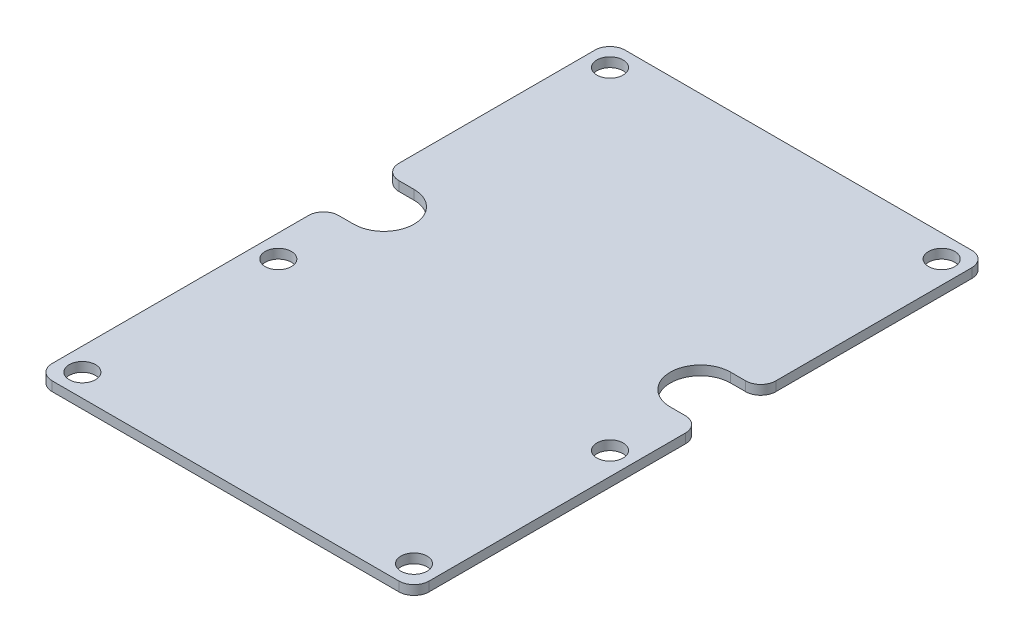
ISO-10303-21;
HEADER;
FILE_DESCRIPTION(('STEP AP214'),'2;1');
FILE_NAME('part.step','',(''),(''),'','','');
FILE_SCHEMA(('AUTOMOTIVE_DESIGN { 1 0 10303 214 1 1 1 1 }'));
ENDSEC;
DATA;
#1=APPLICATION_CONTEXT('core data for automotive mechanical design processes');
#2=APPLICATION_PROTOCOL_DEFINITION('international standard','automotive_design',2000,#1);
#3=PRODUCT_CONTEXT('',#1,'mechanical');
#4=PRODUCT('Part','Part','',(#3));
#5=PRODUCT_RELATED_PRODUCT_CATEGORY('part','',(#4));
#6=PRODUCT_DEFINITION_FORMATION('','',#4);
#7=PRODUCT_DEFINITION_CONTEXT('part definition',#1,'design');
#8=PRODUCT_DEFINITION('design','',#6,#7);
#9=PRODUCT_DEFINITION_SHAPE('','',#8);
#10=(LENGTH_UNIT() NAMED_UNIT(*) SI_UNIT(.MILLI.,.METRE.));
#11=(NAMED_UNIT(*) PLANE_ANGLE_UNIT() SI_UNIT($,.RADIAN.));
#12=(NAMED_UNIT(*) SI_UNIT($,.STERADIAN.) SOLID_ANGLE_UNIT());
#13=UNCERTAINTY_MEASURE_WITH_UNIT(LENGTH_MEASURE(1.E-05),#10,'distance_accuracy_value','');
#14=(GEOMETRIC_REPRESENTATION_CONTEXT(3) GLOBAL_UNCERTAINTY_ASSIGNED_CONTEXT((#13)) GLOBAL_UNIT_ASSIGNED_CONTEXT((#10,
#11,#12)) REPRESENTATION_CONTEXT('',''));
#15=CARTESIAN_POINT('',(0.,0.,0.));
#16=DIRECTION('',(0.,0.,1.));
#17=DIRECTION('',(1.,0.,0.));
#18=AXIS2_PLACEMENT_3D('',#15,#16,#17);
#19=CARTESIAN_POINT('',(-29.21,-1.5875,17.78));
#20=DIRECTION('',(0.,1.,0.));
#21=DIRECTION('',(0.,0.,1.));
#22=AXIS2_PLACEMENT_3D('',#19,#20,#21);
#23=CYLINDRICAL_SURFACE('',#22,2.54);
#24=CARTESIAN_POINT('',(-29.21,0.,17.78));
#25=DIRECTION('',(0.,1.,0.));
#26=DIRECTION('',(0.,0.,1.));
#27=AXIS2_PLACEMENT_3D('',#24,#25,#26);
#28=CIRCLE('',#27,2.54);
#29=CARTESIAN_POINT('',(-31.75,0.,17.78));
#30=VERTEX_POINT('',#29);
#31=CARTESIAN_POINT('',(-29.21,0.,20.32));
#32=VERTEX_POINT('',#31);
#33=EDGE_CURVE('E213',#30,#32,#28,.T.);
#34=ORIENTED_EDGE('',*,*,#33,.F.);
#35=DIRECTION('',(0.,1.,0.));
#36=VECTOR('',#35,1.);
#37=CARTESIAN_POINT('',(-31.75,-1.5875,17.78));
#38=LINE('',#37,#36);
#39=CARTESIAN_POINT('',(-31.75,-1.5875,17.78));
#40=VERTEX_POINT('',#39);
#41=EDGE_CURVE('E11',#40,#30,#38,.T.);
#42=ORIENTED_EDGE('',*,*,#41,.F.);
#43=CARTESIAN_POINT('',(-29.21,-1.5875,17.78));
#44=DIRECTION('',(0.,1.,0.));
#45=DIRECTION('',(0.,0.,1.));
#46=AXIS2_PLACEMENT_3D('',#43,#44,#45);
#47=CIRCLE('',#46,2.54);
#48=CARTESIAN_POINT('',(-29.21,-1.5875,20.32));
#49=VERTEX_POINT('',#48);
#50=EDGE_CURVE('E290',#40,#49,#47,.T.);
#51=ORIENTED_EDGE('',*,*,#50,.T.);
#52=DIRECTION('',(0.,1.,0.));
#53=VECTOR('',#52,1.);
#54=CARTESIAN_POINT('',(-29.21,-1.5875,20.32));
#55=LINE('',#54,#53);
#56=EDGE_CURVE('E41',#49,#32,#55,.T.);
#57=ORIENTED_EDGE('',*,*,#56,.T.);
#58=EDGE_LOOP('',(#34,#42,#51,#57));
#59=FACE_BOUND('',#58,.T.);
#60=ADVANCED_FACE('F38',(#59),#23,.T.);
#61=CARTESIAN_POINT('',(-31.75,-1.5875,-25.4));
#62=DIRECTION('',(-1.,0.,0.));
#63=DIRECTION('',(0.,0.,1.));
#64=AXIS2_PLACEMENT_3D('',#61,#62,#63);
#65=PLANE('',#64);
#66=DIRECTION('',(0.,0.,1.));
#67=VECTOR('',#66,1.);
#68=CARTESIAN_POINT('',(-31.75,0.,-25.4));
#69=LINE('',#68,#67);
#70=CARTESIAN_POINT('',(-31.75,0.,-25.4));
#71=VERTEX_POINT('',#70);
#72=EDGE_CURVE('E287',#71,#30,#69,.T.);
#73=ORIENTED_EDGE('',*,*,#72,.F.);
#74=DIRECTION('',(0.,1.,0.));
#75=VECTOR('',#74,1.);
#76=CARTESIAN_POINT('',(-31.75,-1.5875,-25.4));
#77=LINE('',#76,#75);
#78=CARTESIAN_POINT('',(-31.75,-1.5875,-25.4));
#79=VERTEX_POINT('',#78);
#80=EDGE_CURVE('E48',#79,#71,#77,.T.);
#81=ORIENTED_EDGE('',*,*,#80,.F.);
#82=DIRECTION('',(0.,0.,1.));
#83=VECTOR('',#82,1.);
#84=CARTESIAN_POINT('',(-31.75,-1.5875,-25.4));
#85=LINE('',#84,#83);
#86=EDGE_CURVE('E199',#79,#40,#85,.T.);
#87=ORIENTED_EDGE('',*,*,#86,.T.);
#88=ORIENTED_EDGE('',*,*,#41,.T.);
#89=EDGE_LOOP('',(#73,#81,#87,#88));
#90=FACE_BOUND('',#89,.T.);
#91=ADVANCED_FACE('F344',(#90),#65,.T.);
#92=CARTESIAN_POINT('',(-29.21,-1.5875,-25.4));
#93=DIRECTION('',(0.,1.,0.));
#94=DIRECTION('',(0.,0.,1.));
#95=AXIS2_PLACEMENT_3D('',#92,#93,#94);
#96=CYLINDRICAL_SURFACE('',#95,2.54);
#97=CARTESIAN_POINT('',(-29.21,0.,-25.4));
#98=DIRECTION('',(0.,1.,0.));
#99=DIRECTION('',(0.,0.,-1.));
#100=AXIS2_PLACEMENT_3D('',#97,#98,#99);
#101=CIRCLE('',#100,2.54);
#102=CARTESIAN_POINT('',(-29.21,0.,-27.94));
#103=VERTEX_POINT('',#102);
#104=EDGE_CURVE('E185',#103,#71,#101,.T.);
#105=ORIENTED_EDGE('',*,*,#104,.F.);
#106=DIRECTION('',(0.,1.,0.));
#107=VECTOR('',#106,1.);
#108=CARTESIAN_POINT('',(-29.21,-1.5875,-27.94));
#109=LINE('',#108,#107);
#110=CARTESIAN_POINT('',(-29.21,-1.5875,-27.94));
#111=VERTEX_POINT('',#110);
#112=EDGE_CURVE('E180',#111,#103,#109,.T.);
#113=ORIENTED_EDGE('',*,*,#112,.F.);
#114=CARTESIAN_POINT('',(-29.21,-1.5875,-25.4));
#115=DIRECTION('',(0.,1.,0.));
#116=DIRECTION('',(0.,0.,-1.));
#117=AXIS2_PLACEMENT_3D('',#114,#115,#116);
#118=CIRCLE('',#117,2.54);
#119=EDGE_CURVE('E183',#111,#79,#118,.T.);
#120=ORIENTED_EDGE('',*,*,#119,.T.);
#121=ORIENTED_EDGE('',*,*,#80,.T.);
#122=EDGE_LOOP('',(#105,#113,#120,#121));
#123=FACE_BOUND('',#122,.T.);
#124=ADVANCED_FACE('F182',(#123),#96,.T.);
#125=CARTESIAN_POINT('',(-26.67,-1.5875,-27.94));
#126=DIRECTION('',(0.,0.,-1.));
#127=DIRECTION('',(-1.,0.,0.));
#128=AXIS2_PLACEMENT_3D('',#125,#126,#127);
#129=PLANE('',#128);
#130=DIRECTION('',(-1.,0.,0.));
#131=VECTOR('',#130,1.);
#132=CARTESIAN_POINT('',(-26.67,0.,-27.94));
#133=LINE('',#132,#131);
#134=CARTESIAN_POINT('',(-26.67,0.,-27.94));
#135=VERTEX_POINT('',#134);
#136=EDGE_CURVE('E282',#135,#103,#133,.T.);
#137=ORIENTED_EDGE('',*,*,#136,.F.);
#138=DIRECTION('',(0.,1.,0.));
#139=VECTOR('',#138,1.);
#140=CARTESIAN_POINT('',(-26.67,-1.5875,-27.94));
#141=LINE('',#140,#139);
#142=CARTESIAN_POINT('',(-26.67,-1.5875,-27.94));
#143=VERTEX_POINT('',#142);
#144=EDGE_CURVE('E191',#143,#135,#141,.T.);
#145=ORIENTED_EDGE('',*,*,#144,.F.);
#146=DIRECTION('',(-1.,0.,0.));
#147=VECTOR('',#146,1.);
#148=CARTESIAN_POINT('',(-26.67,-1.5875,-27.94));
#149=LINE('',#148,#147);
#150=EDGE_CURVE('E197',#143,#111,#149,.T.);
#151=ORIENTED_EDGE('',*,*,#150,.T.);
#152=ORIENTED_EDGE('',*,*,#112,.T.);
#153=EDGE_LOOP('',(#137,#145,#151,#152));
#154=FACE_BOUND('',#153,.T.);
#155=ADVANCED_FACE('F202',(#154),#129,.T.);
#156=CARTESIAN_POINT('',(-26.67,-1.5875,-33.02));
#157=DIRECTION('',(0.,1.,0.));
#158=DIRECTION('',(0.,0.,1.));
#159=AXIS2_PLACEMENT_3D('',#156,#157,#158);
#160=CYLINDRICAL_SURFACE('',#159,5.08);
#161=CARTESIAN_POINT('',(-26.67,0.,-33.02));
#162=DIRECTION('',(0.,-1.,0.));
#163=DIRECTION('',(0.,0.,-1.));
#164=AXIS2_PLACEMENT_3D('',#161,#162,#163);
#165=CIRCLE('',#164,5.08);
#166=CARTESIAN_POINT('',(-26.67,0.,-38.1));
#167=VERTEX_POINT('',#166);
#168=EDGE_CURVE('E278',#167,#135,#165,.T.);
#169=ORIENTED_EDGE('',*,*,#168,.F.);
#170=DIRECTION('',(0.,1.,0.));
#171=VECTOR('',#170,1.);
#172=CARTESIAN_POINT('',(-26.67,-1.5875,-38.1));
#173=LINE('',#172,#171);
#174=CARTESIAN_POINT('',(-26.67,-1.5875,-38.1));
#175=VERTEX_POINT('',#174);
#176=EDGE_CURVE('E296',#175,#167,#173,.T.);
#177=ORIENTED_EDGE('',*,*,#176,.F.);
#178=CARTESIAN_POINT('',(-26.67,-1.5875,-33.02));
#179=DIRECTION('',(0.,-1.,0.));
#180=DIRECTION('',(0.,0.,-1.));
#181=AXIS2_PLACEMENT_3D('',#178,#179,#180);
#182=CIRCLE('',#181,5.08);
#183=EDGE_CURVE('E204',#175,#143,#182,.T.);
#184=ORIENTED_EDGE('',*,*,#183,.T.);
#185=ORIENTED_EDGE('',*,*,#144,.T.);
#186=EDGE_LOOP('',(#169,#177,#184,#185));
#187=FACE_BOUND('',#186,.T.);
#188=ADVANCED_FACE('F357',(#187),#160,.F.);
#189=CARTESIAN_POINT('',(-29.21,-1.5875,-38.1));
#190=DIRECTION('',(0.,0.,1.));
#191=DIRECTION('',(1.,0.,0.));
#192=AXIS2_PLACEMENT_3D('',#189,#190,#191);
#193=PLANE('',#192);
#194=DIRECTION('',(1.,0.,0.));
#195=VECTOR('',#194,1.);
#196=CARTESIAN_POINT('',(-29.21,0.,-38.1));
#197=LINE('',#196,#195);
#198=CARTESIAN_POINT('',(-29.21,0.,-38.1));
#199=VERTEX_POINT('',#198);
#200=EDGE_CURVE('E274',#199,#167,#197,.T.);
#201=ORIENTED_EDGE('',*,*,#200,.F.);
#202=DIRECTION('',(0.,1.,0.));
#203=VECTOR('',#202,1.);
#204=CARTESIAN_POINT('',(-29.21,-1.5875,-38.1));
#205=LINE('',#204,#203);
#206=CARTESIAN_POINT('',(-29.21,-1.5875,-38.1));
#207=VERTEX_POINT('',#206);
#208=EDGE_CURVE('E299',#207,#199,#205,.T.);
#209=ORIENTED_EDGE('',*,*,#208,.F.);
#210=DIRECTION('',(1.,0.,0.));
#211=VECTOR('',#210,1.);
#212=CARTESIAN_POINT('',(-29.21,-1.5875,-38.1));
#213=LINE('',#212,#211);
#214=EDGE_CURVE('E207',#207,#175,#213,.T.);
#215=ORIENTED_EDGE('',*,*,#214,.T.);
#216=ORIENTED_EDGE('',*,*,#176,.T.);
#217=EDGE_LOOP('',(#201,#209,#215,#216));
#218=FACE_BOUND('',#217,.T.);
#219=ADVANCED_FACE('F360',(#218),#193,.T.);
#220=CARTESIAN_POINT('',(-29.21,-1.5875,-40.64));
#221=DIRECTION('',(0.,1.,0.));
#222=DIRECTION('',(0.,0.,1.));
#223=AXIS2_PLACEMENT_3D('',#220,#221,#222);
#224=CYLINDRICAL_SURFACE('',#223,2.54);
#225=CARTESIAN_POINT('',(-29.21,0.,-40.64));
#226=DIRECTION('',(0.,1.,0.));
#227=DIRECTION('',(0.,0.,-1.));
#228=AXIS2_PLACEMENT_3D('',#225,#226,#227);
#229=CIRCLE('',#228,2.54);
#230=CARTESIAN_POINT('',(-31.75,0.,-40.64));
#231=VERTEX_POINT('',#230);
#232=EDGE_CURVE('E270',#231,#199,#229,.T.);
#233=ORIENTED_EDGE('',*,*,#232,.F.);
#234=DIRECTION('',(0.,1.,0.));
#235=VECTOR('',#234,1.);
#236=CARTESIAN_POINT('',(-31.75,-1.5875,-40.64));
#237=LINE('',#236,#235);
#238=CARTESIAN_POINT('',(-31.75,-1.5875,-40.64));
#239=VERTEX_POINT('',#238);
#240=EDGE_CURVE('E302',#239,#231,#237,.T.);
#241=ORIENTED_EDGE('',*,*,#240,.F.);
#242=CARTESIAN_POINT('',(-29.21,-1.5875,-40.64));
#243=DIRECTION('',(0.,1.,0.));
#244=DIRECTION('',(0.,0.,-1.));
#245=AXIS2_PLACEMENT_3D('',#242,#243,#244);
#246=CIRCLE('',#245,2.54);
#247=EDGE_CURVE('E557',#239,#207,#246,.T.);
#248=ORIENTED_EDGE('',*,*,#247,.T.);
#249=ORIENTED_EDGE('',*,*,#208,.T.);
#250=EDGE_LOOP('',(#233,#241,#248,#249));
#251=FACE_BOUND('',#250,.T.);
#252=ADVANCED_FACE('F364',(#251),#224,.T.);
#253=CARTESIAN_POINT('',(-31.75,-1.5875,-73.66));
#254=DIRECTION('',(-1.,0.,0.));
#255=DIRECTION('',(0.,0.,1.));
#256=AXIS2_PLACEMENT_3D('',#253,#254,#255);
#257=PLANE('',#256);
#258=DIRECTION('',(0.,0.,1.));
#259=VECTOR('',#258,1.);
#260=CARTESIAN_POINT('',(-31.75,0.,-73.66));
#261=LINE('',#260,#259);
#262=CARTESIAN_POINT('',(-31.75,0.,-73.66));
#263=VERTEX_POINT('',#262);
#264=EDGE_CURVE('E266',#263,#231,#261,.T.);
#265=ORIENTED_EDGE('',*,*,#264,.F.);
#266=DIRECTION('',(0.,1.,0.));
#267=VECTOR('',#266,1.);
#268=CARTESIAN_POINT('',(-31.75,-1.5875,-73.66));
#269=LINE('',#268,#267);
#270=CARTESIAN_POINT('',(-31.75,-1.5875,-73.66));
#271=VERTEX_POINT('',#270);
#272=EDGE_CURVE('E305',#271,#263,#269,.T.);
#273=ORIENTED_EDGE('',*,*,#272,.F.);
#274=DIRECTION('',(0.,0.,1.));
#275=VECTOR('',#274,1.);
#276=CARTESIAN_POINT('',(-31.75,-1.5875,-73.66));
#277=LINE('',#276,#275);
#278=EDGE_CURVE('E553',#271,#239,#277,.T.);
#279=ORIENTED_EDGE('',*,*,#278,.T.);
#280=ORIENTED_EDGE('',*,*,#240,.T.);
#281=EDGE_LOOP('',(#265,#273,#279,#280));
#282=FACE_BOUND('',#281,.T.);
#283=ADVANCED_FACE('F368',(#282),#257,.T.);
#284=CARTESIAN_POINT('',(-29.21,-1.5875,-73.66));
#285=DIRECTION('',(0.,1.,0.));
#286=DIRECTION('',(0.,0.,1.));
#287=AXIS2_PLACEMENT_3D('',#284,#285,#286);
#288=CYLINDRICAL_SURFACE('',#287,2.54);
#289=CARTESIAN_POINT('',(-29.21,0.,-73.66));
#290=DIRECTION('',(0.,1.,0.));
#291=DIRECTION('',(0.,0.,1.));
#292=AXIS2_PLACEMENT_3D('',#289,#290,#291);
#293=CIRCLE('',#292,2.54);
#294=CARTESIAN_POINT('',(-29.21,0.,-76.2));
#295=VERTEX_POINT('',#294);
#296=EDGE_CURVE('E262',#295,#263,#293,.T.);
#297=ORIENTED_EDGE('',*,*,#296,.F.);
#298=DIRECTION('',(0.,1.,0.));
#299=VECTOR('',#298,1.);
#300=CARTESIAN_POINT('',(-29.21,-1.5875,-76.2));
#301=LINE('',#300,#299);
#302=CARTESIAN_POINT('',(-29.21,-1.5875,-76.2));
#303=VERTEX_POINT('',#302);
#304=EDGE_CURVE('E308',#303,#295,#301,.T.);
#305=ORIENTED_EDGE('',*,*,#304,.F.);
#306=CARTESIAN_POINT('',(-29.21,-1.5875,-73.66));
#307=DIRECTION('',(0.,1.,0.));
#308=DIRECTION('',(0.,0.,1.));
#309=AXIS2_PLACEMENT_3D('',#306,#307,#308);
#310=CIRCLE('',#309,2.54);
#311=EDGE_CURVE('E549',#303,#271,#310,.T.);
#312=ORIENTED_EDGE('',*,*,#311,.T.);
#313=ORIENTED_EDGE('',*,*,#272,.T.);
#314=EDGE_LOOP('',(#297,#305,#312,#313));
#315=FACE_BOUND('',#314,.T.);
#316=ADVANCED_FACE('F372',(#315),#288,.T.);
#317=CARTESIAN_POINT('',(-29.21,-1.5875,-76.2));
#318=DIRECTION('',(0.,0.,-1.));
#319=DIRECTION('',(-1.,0.,0.));
#320=AXIS2_PLACEMENT_3D('',#317,#318,#319);
#321=PLANE('',#320);
#322=DIRECTION('',(-1.,0.,0.));
#323=VECTOR('',#322,1.);
#324=CARTESIAN_POINT('',(-29.21,0.,-76.2));
#325=LINE('',#324,#323);
#326=CARTESIAN_POINT('',(29.21,0.,-76.2));
#327=VERTEX_POINT('',#326);
#328=EDGE_CURVE('E258',#327,#295,#325,.T.);
#329=ORIENTED_EDGE('',*,*,#328,.F.);
#330=DIRECTION('',(0.,1.,0.));
#331=VECTOR('',#330,1.);
#332=CARTESIAN_POINT('',(29.21,-1.5875,-76.2));
#333=LINE('',#332,#331);
#334=CARTESIAN_POINT('',(29.21,-1.5875,-76.2));
#335=VERTEX_POINT('',#334);
#336=EDGE_CURVE('E311',#335,#327,#333,.T.);
#337=ORIENTED_EDGE('',*,*,#336,.F.);
#338=DIRECTION('',(-1.,0.,0.));
#339=VECTOR('',#338,1.);
#340=CARTESIAN_POINT('',(-29.21,-1.5875,-76.2));
#341=LINE('',#340,#339);
#342=EDGE_CURVE('E545',#335,#303,#341,.T.);
#343=ORIENTED_EDGE('',*,*,#342,.T.);
#344=ORIENTED_EDGE('',*,*,#304,.T.);
#345=EDGE_LOOP('',(#329,#337,#343,#344));
#346=FACE_BOUND('',#345,.T.);
#347=ADVANCED_FACE('F376',(#346),#321,.T.);
#348=CARTESIAN_POINT('',(29.21,-1.5875,-73.66));
#349=DIRECTION('',(0.,1.,0.));
#350=DIRECTION('',(0.,0.,1.));
#351=AXIS2_PLACEMENT_3D('',#348,#349,#350);
#352=CYLINDRICAL_SURFACE('',#351,2.54);
#353=CARTESIAN_POINT('',(29.21,0.,-73.66));
#354=DIRECTION('',(0.,1.,0.));
#355=DIRECTION('',(0.,0.,-1.));
#356=AXIS2_PLACEMENT_3D('',#353,#354,#355);
#357=CIRCLE('',#356,2.54);
#358=CARTESIAN_POINT('',(31.75,0.,-73.66));
#359=VERTEX_POINT('',#358);
#360=EDGE_CURVE('E254',#359,#327,#357,.T.);
#361=ORIENTED_EDGE('',*,*,#360,.F.);
#362=DIRECTION('',(0.,1.,0.));
#363=VECTOR('',#362,1.);
#364=CARTESIAN_POINT('',(31.75,-1.5875,-73.66));
#365=LINE('',#364,#363);
#366=CARTESIAN_POINT('',(31.75,-1.5875,-73.66));
#367=VERTEX_POINT('',#366);
#368=EDGE_CURVE('E314',#367,#359,#365,.T.);
#369=ORIENTED_EDGE('',*,*,#368,.F.);
#370=CARTESIAN_POINT('',(29.21,-1.5875,-73.66));
#371=DIRECTION('',(0.,1.,0.));
#372=DIRECTION('',(0.,0.,-1.));
#373=AXIS2_PLACEMENT_3D('',#370,#371,#372);
#374=CIRCLE('',#373,2.54);
#375=EDGE_CURVE('E541',#367,#335,#374,.T.);
#376=ORIENTED_EDGE('',*,*,#375,.T.);
#377=ORIENTED_EDGE('',*,*,#336,.T.);
#378=EDGE_LOOP('',(#361,#369,#376,#377));
#379=FACE_BOUND('',#378,.T.);
#380=ADVANCED_FACE('F380',(#379),#352,.T.);
#381=CARTESIAN_POINT('',(31.75,-1.5875,-40.64));
#382=DIRECTION('',(1.,0.,0.));
#383=DIRECTION('',(0.,0.,-1.));
#384=AXIS2_PLACEMENT_3D('',#381,#382,#383);
#385=PLANE('',#384);
#386=DIRECTION('',(0.,0.,-1.));
#387=VECTOR('',#386,1.);
#388=CARTESIAN_POINT('',(31.75,0.,-40.64));
#389=LINE('',#388,#387);
#390=CARTESIAN_POINT('',(31.75,0.,-40.64));
#391=VERTEX_POINT('',#390);
#392=EDGE_CURVE('E250',#391,#359,#389,.T.);
#393=ORIENTED_EDGE('',*,*,#392,.F.);
#394=DIRECTION('',(0.,1.,0.));
#395=VECTOR('',#394,1.);
#396=CARTESIAN_POINT('',(31.75,-1.5875,-40.64));
#397=LINE('',#396,#395);
#398=CARTESIAN_POINT('',(31.75,-1.5875,-40.64));
#399=VERTEX_POINT('',#398);
#400=EDGE_CURVE('E317',#399,#391,#397,.T.);
#401=ORIENTED_EDGE('',*,*,#400,.F.);
#402=DIRECTION('',(0.,0.,-1.));
#403=VECTOR('',#402,1.);
#404=CARTESIAN_POINT('',(31.75,-1.5875,-40.64));
#405=LINE('',#404,#403);
#406=EDGE_CURVE('E537',#399,#367,#405,.T.);
#407=ORIENTED_EDGE('',*,*,#406,.T.);
#408=ORIENTED_EDGE('',*,*,#368,.T.);
#409=EDGE_LOOP('',(#393,#401,#407,#408));
#410=FACE_BOUND('',#409,.T.);
#411=ADVANCED_FACE('F384',(#410),#385,.T.);
#412=CARTESIAN_POINT('',(29.21,-1.5875,-40.64));
#413=DIRECTION('',(0.,1.,0.));
#414=DIRECTION('',(0.,0.,1.));
#415=AXIS2_PLACEMENT_3D('',#412,#413,#414);
#416=CYLINDRICAL_SURFACE('',#415,2.54);
#417=CARTESIAN_POINT('',(29.21,0.,-40.64));
#418=DIRECTION('',(0.,1.,0.));
#419=DIRECTION('',(0.,0.,1.));
#420=AXIS2_PLACEMENT_3D('',#417,#418,#419);
#421=CIRCLE('',#420,2.54);
#422=CARTESIAN_POINT('',(29.21,0.,-38.1));
#423=VERTEX_POINT('',#422);
#424=EDGE_CURVE('E246',#423,#391,#421,.T.);
#425=ORIENTED_EDGE('',*,*,#424,.F.);
#426=DIRECTION('',(0.,1.,0.));
#427=VECTOR('',#426,1.);
#428=CARTESIAN_POINT('',(29.21,-1.5875,-38.1));
#429=LINE('',#428,#427);
#430=CARTESIAN_POINT('',(29.21,-1.5875,-38.1));
#431=VERTEX_POINT('',#430);
#432=EDGE_CURVE('E320',#431,#423,#429,.T.);
#433=ORIENTED_EDGE('',*,*,#432,.F.);
#434=CARTESIAN_POINT('',(29.21,-1.5875,-40.64));
#435=DIRECTION('',(0.,1.,0.));
#436=DIRECTION('',(0.,0.,1.));
#437=AXIS2_PLACEMENT_3D('',#434,#435,#436);
#438=CIRCLE('',#437,2.54);
#439=EDGE_CURVE('E533',#431,#399,#438,.T.);
#440=ORIENTED_EDGE('',*,*,#439,.T.);
#441=ORIENTED_EDGE('',*,*,#400,.T.);
#442=EDGE_LOOP('',(#425,#433,#440,#441));
#443=FACE_BOUND('',#442,.T.);
#444=ADVANCED_FACE('F388',(#443),#416,.T.);
#445=CARTESIAN_POINT('',(29.21,-1.5875,-38.1));
#446=DIRECTION('',(0.,0.,1.));
#447=DIRECTION('',(1.,0.,0.));
#448=AXIS2_PLACEMENT_3D('',#445,#446,#447);
#449=PLANE('',#448);
#450=DIRECTION('',(1.,0.,0.));
#451=VECTOR('',#450,1.);
#452=CARTESIAN_POINT('',(29.21,0.,-38.1));
#453=LINE('',#452,#451);
#454=CARTESIAN_POINT('',(26.67,0.,-38.1));
#455=VERTEX_POINT('',#454);
#456=EDGE_CURVE('E242',#455,#423,#453,.T.);
#457=ORIENTED_EDGE('',*,*,#456,.F.);
#458=DIRECTION('',(0.,1.,0.));
#459=VECTOR('',#458,1.);
#460=CARTESIAN_POINT('',(26.67,-1.5875,-38.1));
#461=LINE('',#460,#459);
#462=CARTESIAN_POINT('',(26.67,-1.5875,-38.1));
#463=VERTEX_POINT('',#462);
#464=EDGE_CURVE('E323',#463,#455,#461,.T.);
#465=ORIENTED_EDGE('',*,*,#464,.F.);
#466=DIRECTION('',(1.,0.,0.));
#467=VECTOR('',#466,1.);
#468=CARTESIAN_POINT('',(29.21,-1.5875,-38.1));
#469=LINE('',#468,#467);
#470=EDGE_CURVE('E529',#463,#431,#469,.T.);
#471=ORIENTED_EDGE('',*,*,#470,.T.);
#472=ORIENTED_EDGE('',*,*,#432,.T.);
#473=EDGE_LOOP('',(#457,#465,#471,#472));
#474=FACE_BOUND('',#473,.T.);
#475=ADVANCED_FACE('F392',(#474),#449,.T.);
#476=CARTESIAN_POINT('',(26.67,-1.5875,-33.02));
#477=DIRECTION('',(0.,1.,0.));
#478=DIRECTION('',(0.,0.,1.));
#479=AXIS2_PLACEMENT_3D('',#476,#477,#478);
#480=CYLINDRICAL_SURFACE('',#479,5.08);
#481=CARTESIAN_POINT('',(26.67,0.,-33.02));
#482=DIRECTION('',(0.,-1.,0.));
#483=DIRECTION('',(0.,0.,1.));
#484=AXIS2_PLACEMENT_3D('',#481,#482,#483);
#485=CIRCLE('',#484,5.08);
#486=CARTESIAN_POINT('',(26.67,0.,-27.94));
#487=VERTEX_POINT('',#486);
#488=EDGE_CURVE('E238',#487,#455,#485,.T.);
#489=ORIENTED_EDGE('',*,*,#488,.F.);
#490=DIRECTION('',(0.,1.,0.));
#491=VECTOR('',#490,1.);
#492=CARTESIAN_POINT('',(26.67,-1.5875,-27.94));
#493=LINE('',#492,#491);
#494=CARTESIAN_POINT('',(26.67,-1.5875,-27.94));
#495=VERTEX_POINT('',#494);
#496=EDGE_CURVE('E326',#495,#487,#493,.T.);
#497=ORIENTED_EDGE('',*,*,#496,.F.);
#498=CARTESIAN_POINT('',(26.67,-1.5875,-33.02));
#499=DIRECTION('',(0.,-1.,0.));
#500=DIRECTION('',(0.,0.,1.));
#501=AXIS2_PLACEMENT_3D('',#498,#499,#500);
#502=CIRCLE('',#501,5.08);
#503=EDGE_CURVE('E525',#495,#463,#502,.T.);
#504=ORIENTED_EDGE('',*,*,#503,.T.);
#505=ORIENTED_EDGE('',*,*,#464,.T.);
#506=EDGE_LOOP('',(#489,#497,#504,#505));
#507=FACE_BOUND('',#506,.T.);
#508=ADVANCED_FACE('F396',(#507),#480,.F.);
#509=CARTESIAN_POINT('',(26.67,-1.5875,-27.94));
#510=DIRECTION('',(0.,0.,-1.));
#511=DIRECTION('',(-1.,0.,0.));
#512=AXIS2_PLACEMENT_3D('',#509,#510,#511);
#513=PLANE('',#512);
#514=DIRECTION('',(-1.,0.,0.));
#515=VECTOR('',#514,1.);
#516=CARTESIAN_POINT('',(26.67,0.,-27.94));
#517=LINE('',#516,#515);
#518=CARTESIAN_POINT('',(29.21,0.,-27.94));
#519=VERTEX_POINT('',#518);
#520=EDGE_CURVE('E234',#519,#487,#517,.T.);
#521=ORIENTED_EDGE('',*,*,#520,.F.);
#522=DIRECTION('',(0.,1.,0.));
#523=VECTOR('',#522,1.);
#524=CARTESIAN_POINT('',(29.21,-1.5875,-27.94));
#525=LINE('',#524,#523);
#526=CARTESIAN_POINT('',(29.21,-1.5875,-27.94));
#527=VERTEX_POINT('',#526);
#528=EDGE_CURVE('E329',#527,#519,#525,.T.);
#529=ORIENTED_EDGE('',*,*,#528,.F.);
#530=DIRECTION('',(-1.,0.,0.));
#531=VECTOR('',#530,1.);
#532=CARTESIAN_POINT('',(26.67,-1.5875,-27.94));
#533=LINE('',#532,#531);
#534=EDGE_CURVE('E521',#527,#495,#533,.T.);
#535=ORIENTED_EDGE('',*,*,#534,.T.);
#536=ORIENTED_EDGE('',*,*,#496,.T.);
#537=EDGE_LOOP('',(#521,#529,#535,#536));
#538=FACE_BOUND('',#537,.T.);
#539=ADVANCED_FACE('F400',(#538),#513,.T.);
#540=CARTESIAN_POINT('',(29.21,-1.5875,-25.4));
#541=DIRECTION('',(0.,1.,0.));
#542=DIRECTION('',(0.,0.,1.));
#543=AXIS2_PLACEMENT_3D('',#540,#541,#542);
#544=CYLINDRICAL_SURFACE('',#543,2.54);
#545=CARTESIAN_POINT('',(29.21,0.,-25.4));
#546=DIRECTION('',(0.,1.,0.));
#547=DIRECTION('',(0.,0.,-1.));
#548=AXIS2_PLACEMENT_3D('',#545,#546,#547);
#549=CIRCLE('',#548,2.54);
#550=CARTESIAN_POINT('',(31.75,0.,-25.4));
#551=VERTEX_POINT('',#550);
#552=EDGE_CURVE('E230',#551,#519,#549,.T.);
#553=ORIENTED_EDGE('',*,*,#552,.F.);
#554=DIRECTION('',(0.,1.,0.));
#555=VECTOR('',#554,1.);
#556=CARTESIAN_POINT('',(31.75,-1.5875,-25.4));
#557=LINE('',#556,#555);
#558=CARTESIAN_POINT('',(31.75,-1.5875,-25.4));
#559=VERTEX_POINT('',#558);
#560=EDGE_CURVE('E332',#559,#551,#557,.T.);
#561=ORIENTED_EDGE('',*,*,#560,.F.);
#562=CARTESIAN_POINT('',(29.21,-1.5875,-25.4));
#563=DIRECTION('',(0.,1.,0.));
#564=DIRECTION('',(0.,0.,-1.));
#565=AXIS2_PLACEMENT_3D('',#562,#563,#564);
#566=CIRCLE('',#565,2.54);
#567=EDGE_CURVE('E517',#559,#527,#566,.T.);
#568=ORIENTED_EDGE('',*,*,#567,.T.);
#569=ORIENTED_EDGE('',*,*,#528,.T.);
#570=EDGE_LOOP('',(#553,#561,#568,#569));
#571=FACE_BOUND('',#570,.T.);
#572=ADVANCED_FACE('F404',(#571),#544,.T.);
#573=CARTESIAN_POINT('',(31.75,-1.5875,17.78));
#574=DIRECTION('',(1.,0.,0.));
#575=DIRECTION('',(0.,0.,-1.));
#576=AXIS2_PLACEMENT_3D('',#573,#574,#575);
#577=PLANE('',#576);
#578=DIRECTION('',(0.,0.,-1.));
#579=VECTOR('',#578,1.);
#580=CARTESIAN_POINT('',(31.75,0.,17.78));
#581=LINE('',#580,#579);
#582=CARTESIAN_POINT('',(31.75,0.,17.78));
#583=VERTEX_POINT('',#582);
#584=EDGE_CURVE('E226',#583,#551,#581,.T.);
#585=ORIENTED_EDGE('',*,*,#584,.F.);
#586=DIRECTION('',(0.,1.,0.));
#587=VECTOR('',#586,1.);
#588=CARTESIAN_POINT('',(31.75,-1.5875,17.78));
#589=LINE('',#588,#587);
#590=CARTESIAN_POINT('',(31.75,-1.5875,17.78));
#591=VERTEX_POINT('',#590);
#592=EDGE_CURVE('E335',#591,#583,#589,.T.);
#593=ORIENTED_EDGE('',*,*,#592,.F.);
#594=DIRECTION('',(0.,0.,-1.));
#595=VECTOR('',#594,1.);
#596=CARTESIAN_POINT('',(31.75,-1.5875,17.78));
#597=LINE('',#596,#595);
#598=EDGE_CURVE('E513',#591,#559,#597,.T.);
#599=ORIENTED_EDGE('',*,*,#598,.T.);
#600=ORIENTED_EDGE('',*,*,#560,.T.);
#601=EDGE_LOOP('',(#585,#593,#599,#600));
#602=FACE_BOUND('',#601,.T.);
#603=ADVANCED_FACE('F408',(#602),#577,.T.);
#604=CARTESIAN_POINT('',(29.21,-1.5875,17.78));
#605=DIRECTION('',(0.,1.,0.));
#606=DIRECTION('',(0.,0.,1.));
#607=AXIS2_PLACEMENT_3D('',#604,#605,#606);
#608=CYLINDRICAL_SURFACE('',#607,2.54);
#609=CARTESIAN_POINT('',(29.21,0.,17.78));
#610=DIRECTION('',(0.,1.,0.));
#611=DIRECTION('',(0.,0.,1.));
#612=AXIS2_PLACEMENT_3D('',#609,#610,#611);
#613=CIRCLE('',#612,2.54);
#614=CARTESIAN_POINT('',(29.21,0.,20.32));
#615=VERTEX_POINT('',#614);
#616=EDGE_CURVE('E222',#615,#583,#613,.T.);
#617=ORIENTED_EDGE('',*,*,#616,.F.);
#618=DIRECTION('',(0.,1.,0.));
#619=VECTOR('',#618,1.);
#620=CARTESIAN_POINT('',(29.21,-1.5875,20.32));
#621=LINE('',#620,#619);
#622=CARTESIAN_POINT('',(29.21,-1.5875,20.32));
#623=VERTEX_POINT('',#622);
#624=EDGE_CURVE('E337',#623,#615,#621,.T.);
#625=ORIENTED_EDGE('',*,*,#624,.F.);
#626=CARTESIAN_POINT('',(29.21,-1.5875,17.78));
#627=DIRECTION('',(0.,1.,0.));
#628=DIRECTION('',(0.,0.,1.));
#629=AXIS2_PLACEMENT_3D('',#626,#627,#628);
#630=CIRCLE('',#629,2.54);
#631=EDGE_CURVE('E509',#623,#591,#630,.T.);
#632=ORIENTED_EDGE('',*,*,#631,.T.);
#633=ORIENTED_EDGE('',*,*,#592,.T.);
#634=EDGE_LOOP('',(#617,#625,#632,#633));
#635=FACE_BOUND('',#634,.T.);
#636=ADVANCED_FACE('F412',(#635),#608,.T.);
#637=CARTESIAN_POINT('',(-29.21,-1.5875,20.32));
#638=DIRECTION('',(0.,0.,1.));
#639=DIRECTION('',(1.,0.,0.));
#640=AXIS2_PLACEMENT_3D('',#637,#638,#639);
#641=PLANE('',#640);
#642=DIRECTION('',(1.,0.,0.));
#643=VECTOR('',#642,1.);
#644=CARTESIAN_POINT('',(-29.21,0.,20.32));
#645=LINE('',#644,#643);
#646=EDGE_CURVE('E217',#32,#615,#645,.T.);
#647=ORIENTED_EDGE('',*,*,#646,.F.);
#648=ORIENTED_EDGE('',*,*,#56,.F.);
#649=DIRECTION('',(1.,0.,0.));
#650=VECTOR('',#649,1.);
#651=CARTESIAN_POINT('',(-29.21,-1.5875,20.32));
#652=LINE('',#651,#650);
#653=EDGE_CURVE('E506',#49,#623,#652,.T.);
#654=ORIENTED_EDGE('',*,*,#653,.T.);
#655=ORIENTED_EDGE('',*,*,#624,.T.);
#656=EDGE_LOOP('',(#647,#648,#654,#655));
#657=FACE_BOUND('',#656,.T.);
#658=ADVANCED_FACE('F341',(#657),#641,.T.);
#659=CARTESIAN_POINT('',(-29.21,-1.5875,17.78));
#660=DIRECTION('',(0.,1.,0.));
#661=DIRECTION('',(0.,0.,1.));
#662=AXIS2_PLACEMENT_3D('',#659,#660,#661);
#663=PLANE('',#662);
#664=CARTESIAN_POINT('',(-27.94,-1.5875,-16.51));
#665=DIRECTION('',(0.,1.,0.));
#666=DIRECTION('',(0.,0.,1.));
#667=AXIS2_PLACEMENT_3D('',#664,#665,#666);
#668=CIRCLE('',#667,2.2098);
#669=CARTESIAN_POINT('',(-27.94,-1.5875,-14.3002));
#670=VERTEX_POINT('',#669);
#671=EDGE_CURVE('E476',#670,#670,#668,.T.);
#672=ORIENTED_EDGE('',*,*,#671,.T.);
#673=EDGE_LOOP('',(#672));
#674=FACE_BOUND('',#673,.T.);
#675=CARTESIAN_POINT('',(27.94,-1.5875,16.51));
#676=DIRECTION('',(0.,1.,0.));
#677=DIRECTION('',(0.,0.,1.));
#678=AXIS2_PLACEMENT_3D('',#675,#676,#677);
#679=CIRCLE('',#678,2.2098);
#680=CARTESIAN_POINT('',(27.94,-1.5875,18.7198));
#681=VERTEX_POINT('',#680);
#682=EDGE_CURVE('E467',#681,#681,#679,.T.);
#683=ORIENTED_EDGE('',*,*,#682,.T.);
#684=EDGE_LOOP('',(#683));
#685=FACE_BOUND('',#684,.T.);
#686=CARTESIAN_POINT('',(-27.94,-1.5875,16.51));
#687=DIRECTION('',(0.,1.,0.));
#688=DIRECTION('',(0.,0.,-1.));
#689=AXIS2_PLACEMENT_3D('',#686,#687,#688);
#690=CIRCLE('',#689,2.2098);
#691=CARTESIAN_POINT('',(-27.94,-1.5875,14.3002));
#692=VERTEX_POINT('',#691);
#693=EDGE_CURVE('E491',#692,#692,#690,.T.);
#694=ORIENTED_EDGE('',*,*,#693,.T.);
#695=EDGE_LOOP('',(#694));
#696=FACE_BOUND('',#695,.T.);
#697=CARTESIAN_POINT('',(27.94,-1.5875,-72.39));
#698=DIRECTION('',(0.,1.,0.));
#699=DIRECTION('',(0.,0.,-1.));
#700=AXIS2_PLACEMENT_3D('',#697,#698,#699);
#701=CIRCLE('',#700,2.2098);
#702=CARTESIAN_POINT('',(27.94,-1.5875,-74.5998));
#703=VERTEX_POINT('',#702);
#704=EDGE_CURVE('E482',#703,#703,#701,.T.);
#705=ORIENTED_EDGE('',*,*,#704,.T.);
#706=EDGE_LOOP('',(#705));
#707=FACE_BOUND('',#706,.T.);
#708=CARTESIAN_POINT('',(27.94,-1.5875,-16.51));
#709=DIRECTION('',(0.,1.,0.));
#710=DIRECTION('',(0.,0.,-1.));
#711=AXIS2_PLACEMENT_3D('',#708,#709,#710);
#712=CIRCLE('',#711,2.2098);
#713=CARTESIAN_POINT('',(27.94,-1.5875,-18.7198));
#714=VERTEX_POINT('',#713);
#715=EDGE_CURVE('E456',#714,#714,#712,.T.);
#716=ORIENTED_EDGE('',*,*,#715,.T.);
#717=EDGE_LOOP('',(#716));
#718=FACE_BOUND('',#717,.T.);
#719=CARTESIAN_POINT('',(-27.94,-1.5875,-72.39));
#720=DIRECTION('',(0.,1.,0.));
#721=DIRECTION('',(0.,0.,1.));
#722=AXIS2_PLACEMENT_3D('',#719,#720,#721);
#723=CIRCLE('',#722,2.2098);
#724=CARTESIAN_POINT('',(-27.94,-1.5875,-70.1802));
#725=VERTEX_POINT('',#724);
#726=EDGE_CURVE('E218',#725,#725,#723,.T.);
#727=ORIENTED_EDGE('',*,*,#726,.T.);
#728=EDGE_LOOP('',(#727));
#729=FACE_BOUND('',#728,.T.);
#730=ORIENTED_EDGE('',*,*,#50,.F.);
#731=ORIENTED_EDGE('',*,*,#86,.F.);
#732=ORIENTED_EDGE('',*,*,#119,.F.);
#733=ORIENTED_EDGE('',*,*,#150,.F.);
#734=ORIENTED_EDGE('',*,*,#183,.F.);
#735=ORIENTED_EDGE('',*,*,#214,.F.);
#736=ORIENTED_EDGE('',*,*,#247,.F.);
#737=ORIENTED_EDGE('',*,*,#278,.F.);
#738=ORIENTED_EDGE('',*,*,#311,.F.);
#739=ORIENTED_EDGE('',*,*,#342,.F.);
#740=ORIENTED_EDGE('',*,*,#375,.F.);
#741=ORIENTED_EDGE('',*,*,#406,.F.);
#742=ORIENTED_EDGE('',*,*,#439,.F.);
#743=ORIENTED_EDGE('',*,*,#470,.F.);
#744=ORIENTED_EDGE('',*,*,#503,.F.);
#745=ORIENTED_EDGE('',*,*,#534,.F.);
#746=ORIENTED_EDGE('',*,*,#567,.F.);
#747=ORIENTED_EDGE('',*,*,#598,.F.);
#748=ORIENTED_EDGE('',*,*,#631,.F.);
#749=ORIENTED_EDGE('',*,*,#653,.F.);
#750=EDGE_LOOP('',(#730,#731,#732,#733,#734,#735,#736,#737,#738,#739,#740,#741,#742,#743,#744,
#745,#746,#747,#748,#749));
#751=FACE_BOUND('',#750,.T.);
#752=ADVANCED_FACE('F195',(#674,#685,#696,#707,#718,#729,#751),#663,.F.);
#753=CARTESIAN_POINT('',(-29.21,0.,17.78));
#754=DIRECTION('',(0.,1.,0.));
#755=DIRECTION('',(0.,0.,1.));
#756=AXIS2_PLACEMENT_3D('',#753,#754,#755);
#757=PLANE('',#756);
#758=CARTESIAN_POINT('',(-27.94,0.,-16.51));
#759=DIRECTION('',(0.,1.,0.));
#760=DIRECTION('',(0.,0.,1.));
#761=AXIS2_PLACEMENT_3D('',#758,#759,#760);
#762=CIRCLE('',#761,2.2098);
#763=CARTESIAN_POINT('',(-27.94,0.,-14.3002));
#764=VERTEX_POINT('',#763);
#765=EDGE_CURVE('E464',#764,#764,#762,.T.);
#766=ORIENTED_EDGE('',*,*,#765,.F.);
#767=EDGE_LOOP('',(#766));
#768=FACE_BOUND('',#767,.T.);
#769=CARTESIAN_POINT('',(27.94,0.,16.51));
#770=DIRECTION('',(0.,1.,0.));
#771=DIRECTION('',(0.,0.,1.));
#772=AXIS2_PLACEMENT_3D('',#769,#770,#771);
#773=CIRCLE('',#772,2.2098);
#774=CARTESIAN_POINT('',(27.94,0.,18.7198));
#775=VERTEX_POINT('',#774);
#776=EDGE_CURVE('E472',#775,#775,#773,.T.);
#777=ORIENTED_EDGE('',*,*,#776,.F.);
#778=EDGE_LOOP('',(#777));
#779=FACE_BOUND('',#778,.T.);
#780=CARTESIAN_POINT('',(-27.94,0.,16.51));
#781=DIRECTION('',(0.,1.,0.));
#782=DIRECTION('',(0.,0.,-1.));
#783=AXIS2_PLACEMENT_3D('',#780,#781,#782);
#784=CIRCLE('',#783,2.2098);
#785=CARTESIAN_POINT('',(-27.94,0.,14.3002));
#786=VERTEX_POINT('',#785);
#787=EDGE_CURVE('E471',#786,#786,#784,.T.);
#788=ORIENTED_EDGE('',*,*,#787,.F.);
#789=EDGE_LOOP('',(#788));
#790=FACE_BOUND('',#789,.T.);
#791=CARTESIAN_POINT('',(27.94,0.,-72.39));
#792=DIRECTION('',(0.,1.,0.));
#793=DIRECTION('',(0.,0.,-1.));
#794=AXIS2_PLACEMENT_3D('',#791,#792,#793);
#795=CIRCLE('',#794,2.2098);
#796=CARTESIAN_POINT('',(27.94,0.,-74.5998));
#797=VERTEX_POINT('',#796);
#798=EDGE_CURVE('E487',#797,#797,#795,.T.);
#799=ORIENTED_EDGE('',*,*,#798,.F.);
#800=EDGE_LOOP('',(#799));
#801=FACE_BOUND('',#800,.T.);
#802=CARTESIAN_POINT('',(27.94,0.,-16.51));
#803=DIRECTION('',(0.,1.,0.));
#804=DIRECTION('',(0.,0.,-1.));
#805=AXIS2_PLACEMENT_3D('',#802,#803,#804);
#806=CIRCLE('',#805,2.2098);
#807=CARTESIAN_POINT('',(27.94,0.,-18.7198));
#808=VERTEX_POINT('',#807);
#809=EDGE_CURVE('E459',#808,#808,#806,.T.);
#810=ORIENTED_EDGE('',*,*,#809,.F.);
#811=EDGE_LOOP('',(#810));
#812=FACE_BOUND('',#811,.T.);
#813=CARTESIAN_POINT('',(-27.94,0.,-72.39));
#814=DIRECTION('',(0.,1.,0.));
#815=DIRECTION('',(0.,0.,1.));
#816=AXIS2_PLACEMENT_3D('',#813,#814,#815);
#817=CIRCLE('',#816,2.2098);
#818=CARTESIAN_POINT('',(-27.94,0.,-70.1802));
#819=VERTEX_POINT('',#818);
#820=EDGE_CURVE('E486',#819,#819,#817,.T.);
#821=ORIENTED_EDGE('',*,*,#820,.F.);
#822=EDGE_LOOP('',(#821));
#823=FACE_BOUND('',#822,.T.);
#824=ORIENTED_EDGE('',*,*,#33,.T.);
#825=ORIENTED_EDGE('',*,*,#646,.T.);
#826=ORIENTED_EDGE('',*,*,#616,.T.);
#827=ORIENTED_EDGE('',*,*,#584,.T.);
#828=ORIENTED_EDGE('',*,*,#552,.T.);
#829=ORIENTED_EDGE('',*,*,#520,.T.);
#830=ORIENTED_EDGE('',*,*,#488,.T.);
#831=ORIENTED_EDGE('',*,*,#456,.T.);
#832=ORIENTED_EDGE('',*,*,#424,.T.);
#833=ORIENTED_EDGE('',*,*,#392,.T.);
#834=ORIENTED_EDGE('',*,*,#360,.T.);
#835=ORIENTED_EDGE('',*,*,#328,.T.);
#836=ORIENTED_EDGE('',*,*,#296,.T.);
#837=ORIENTED_EDGE('',*,*,#264,.T.);
#838=ORIENTED_EDGE('',*,*,#232,.T.);
#839=ORIENTED_EDGE('',*,*,#200,.T.);
#840=ORIENTED_EDGE('',*,*,#168,.T.);
#841=ORIENTED_EDGE('',*,*,#136,.T.);
#842=ORIENTED_EDGE('',*,*,#104,.T.);
#843=ORIENTED_EDGE('',*,*,#72,.T.);
#844=EDGE_LOOP('',(#824,#825,#826,#827,#828,#829,#830,#831,#832,#833,#834,#835,#836,#837,#838,
#839,#840,#841,#842,#843));
#845=FACE_BOUND('',#844,.T.);
#846=ADVANCED_FACE('F343',(#768,#779,#790,#801,#812,#823,#845),#757,.T.);
#847=CARTESIAN_POINT('',(-27.94,-1.5875,-72.39));
#848=DIRECTION('',(0.,1.,0.));
#849=DIRECTION('',(0.,0.,1.));
#850=AXIS2_PLACEMENT_3D('',#847,#848,#849);
#851=CYLINDRICAL_SURFACE('',#850,2.2098);
#852=ORIENTED_EDGE('',*,*,#726,.F.);
#853=EDGE_LOOP('',(#852));
#854=FACE_BOUND('',#853,.T.);
#855=ORIENTED_EDGE('',*,*,#820,.T.);
#856=EDGE_LOOP('',(#855));
#857=FACE_BOUND('',#856,.T.);
#858=ADVANCED_FACE('F424',(#854,#857),#851,.F.);
#859=CARTESIAN_POINT('',(27.94,-1.5875,-16.51));
#860=DIRECTION('',(0.,1.,0.));
#861=DIRECTION('',(0.,0.,1.));
#862=AXIS2_PLACEMENT_3D('',#859,#860,#861);
#863=CYLINDRICAL_SURFACE('',#862,2.2098);
#864=ORIENTED_EDGE('',*,*,#715,.F.);
#865=EDGE_LOOP('',(#864));
#866=FACE_BOUND('',#865,.T.);
#867=ORIENTED_EDGE('',*,*,#809,.T.);
#868=EDGE_LOOP('',(#867));
#869=FACE_BOUND('',#868,.T.);
#870=ADVANCED_FACE('F431',(#866,#869),#863,.F.);
#871=CARTESIAN_POINT('',(27.94,-1.5875,-72.39));
#872=DIRECTION('',(0.,1.,0.));
#873=DIRECTION('',(0.,0.,1.));
#874=AXIS2_PLACEMENT_3D('',#871,#872,#873);
#875=CYLINDRICAL_SURFACE('',#874,2.2098);
#876=ORIENTED_EDGE('',*,*,#704,.F.);
#877=EDGE_LOOP('',(#876));
#878=FACE_BOUND('',#877,.T.);
#879=ORIENTED_EDGE('',*,*,#798,.T.);
#880=EDGE_LOOP('',(#879));
#881=FACE_BOUND('',#880,.T.);
#882=ADVANCED_FACE('F437',(#878,#881),#875,.F.);
#883=CARTESIAN_POINT('',(-27.94,-1.5875,16.51));
#884=DIRECTION('',(0.,1.,0.));
#885=DIRECTION('',(0.,0.,1.));
#886=AXIS2_PLACEMENT_3D('',#883,#884,#885);
#887=CYLINDRICAL_SURFACE('',#886,2.2098);
#888=ORIENTED_EDGE('',*,*,#693,.F.);
#889=EDGE_LOOP('',(#888));
#890=FACE_BOUND('',#889,.T.);
#891=ORIENTED_EDGE('',*,*,#787,.T.);
#892=EDGE_LOOP('',(#891));
#893=FACE_BOUND('',#892,.T.);
#894=ADVANCED_FACE('F433',(#890,#893),#887,.F.);
#895=CARTESIAN_POINT('',(27.94,-1.5875,16.51));
#896=DIRECTION('',(0.,1.,0.));
#897=DIRECTION('',(0.,0.,1.));
#898=AXIS2_PLACEMENT_3D('',#895,#896,#897);
#899=CYLINDRICAL_SURFACE('',#898,2.2098);
#900=ORIENTED_EDGE('',*,*,#682,.F.);
#901=EDGE_LOOP('',(#900));
#902=FACE_BOUND('',#901,.T.);
#903=ORIENTED_EDGE('',*,*,#776,.T.);
#904=EDGE_LOOP('',(#903));
#905=FACE_BOUND('',#904,.T.);
#906=ADVANCED_FACE('F436',(#902,#905),#899,.F.);
#907=CARTESIAN_POINT('',(-27.94,-1.5875,-16.51));
#908=DIRECTION('',(0.,1.,0.));
#909=DIRECTION('',(0.,0.,1.));
#910=AXIS2_PLACEMENT_3D('',#907,#908,#909);
#911=CYLINDRICAL_SURFACE('',#910,2.2098);
#912=ORIENTED_EDGE('',*,*,#671,.F.);
#913=EDGE_LOOP('',(#912));
#914=FACE_BOUND('',#913,.T.);
#915=ORIENTED_EDGE('',*,*,#765,.T.);
#916=EDGE_LOOP('',(#915));
#917=FACE_BOUND('',#916,.T.);
#918=ADVANCED_FACE('F442',(#914,#917),#911,.F.);
#919=CLOSED_SHELL('',(#60,#91,#124,#155,#188,#219,#252,#283,#316,#347,#380,#411,#444,#475,#508,
#539,#572,#603,#636,#658,#752,#846,#858,#870,#882,#894,#906,#918));
#920=MANIFOLD_SOLID_BREP('B2',#919);
#921=ADVANCED_BREP_SHAPE_REPRESENTATION('',(#18,#920),#14);
#922=SHAPE_DEFINITION_REPRESENTATION(#9,#921);
ENDSEC;
END-ISO-10303-21;
